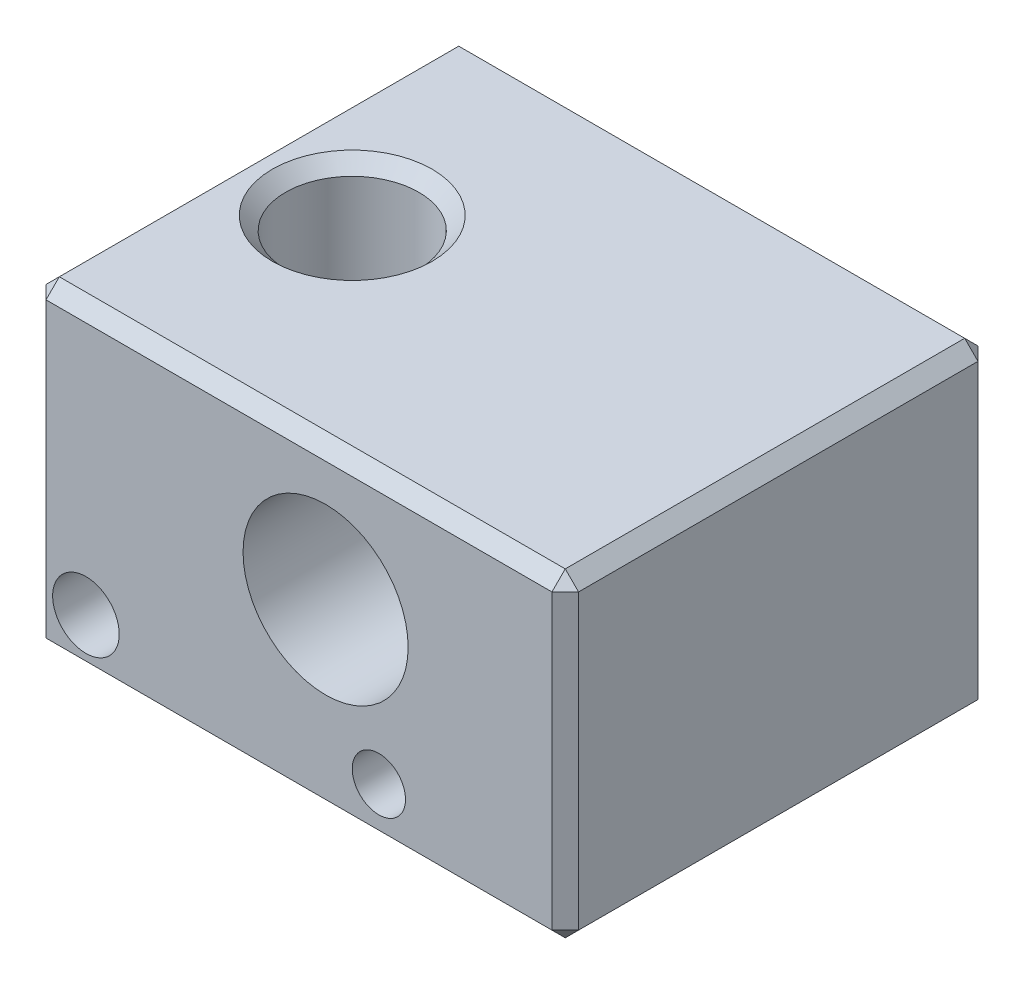
ISO-10303-21;
HEADER;
FILE_DESCRIPTION(('STEP AP214'),'2;1');
FILE_NAME('part.step','',(''),(''),'','','');
FILE_SCHEMA(('AUTOMOTIVE_DESIGN { 1 0 10303 214 1 1 1 1 }'));
ENDSEC;
DATA;
#1=APPLICATION_CONTEXT('core data for automotive mechanical design processes');
#2=APPLICATION_PROTOCOL_DEFINITION('international standard','automotive_design',2000,#1);
#3=PRODUCT_CONTEXT('',#1,'mechanical');
#4=PRODUCT('Part','Part','',(#3));
#5=PRODUCT_RELATED_PRODUCT_CATEGORY('part','',(#4));
#6=PRODUCT_DEFINITION_FORMATION('','',#4);
#7=PRODUCT_DEFINITION_CONTEXT('part definition',#1,'design');
#8=PRODUCT_DEFINITION('design','',#6,#7);
#9=PRODUCT_DEFINITION_SHAPE('','',#8);
#10=(LENGTH_UNIT() NAMED_UNIT(*) SI_UNIT(.MILLI.,.METRE.));
#11=(NAMED_UNIT(*) PLANE_ANGLE_UNIT() SI_UNIT($,.RADIAN.));
#12=(NAMED_UNIT(*) SI_UNIT($,.STERADIAN.) SOLID_ANGLE_UNIT());
#13=UNCERTAINTY_MEASURE_WITH_UNIT(LENGTH_MEASURE(1.E-05),#10,'distance_accuracy_value','');
#14=(GEOMETRIC_REPRESENTATION_CONTEXT(3) GLOBAL_UNCERTAINTY_ASSIGNED_CONTEXT((#13)) GLOBAL_UNIT_ASSIGNED_CONTEXT((#10,
#11,#12)) REPRESENTATION_CONTEXT('',''));
#15=CARTESIAN_POINT('',(0.,0.,0.));
#16=DIRECTION('',(0.,0.,1.));
#17=DIRECTION('',(1.,0.,0.));
#18=AXIS2_PLACEMENT_3D('',#15,#16,#17);
#19=CARTESIAN_POINT('',(-10.,12.,8.));
#20=DIRECTION('',(0.,0.,-1.));
#21=DIRECTION('',(-1.,0.,0.));
#22=AXIS2_PLACEMENT_3D('',#19,#20,#21);
#23=PLANE('',#22);
#24=DIRECTION('',(0.,-1.,0.));
#25=VECTOR('',#24,1.);
#26=CARTESIAN_POINT('',(-9.5,0.,8.));
#27=LINE('',#26,#25);
#28=CARTESIAN_POINT('',(-9.5,11.5,8.));
#29=VERTEX_POINT('',#28);
#30=CARTESIAN_POINT('',(-9.5,0.5,8.));
#31=VERTEX_POINT('',#30);
#32=EDGE_CURVE('E355',#29,#31,#27,.T.);
#33=ORIENTED_EDGE('',*,*,#32,.T.);
#34=DIRECTION('',(1.,0.,0.));
#35=VECTOR('',#34,1.);
#36=CARTESIAN_POINT('',(-10.,0.5,8.));
#37=LINE('',#36,#35);
#38=CARTESIAN_POINT('',(9.5,0.5,8.));
#39=VERTEX_POINT('',#38);
#40=EDGE_CURVE('E363',#31,#39,#37,.T.);
#41=ORIENTED_EDGE('',*,*,#40,.T.);
#42=DIRECTION('',(0.,1.,0.));
#43=VECTOR('',#42,1.);
#44=CARTESIAN_POINT('',(9.5,12.,8.));
#45=LINE('',#44,#43);
#46=CARTESIAN_POINT('',(9.5,11.5,8.));
#47=VERTEX_POINT('',#46);
#48=EDGE_CURVE('E345',#39,#47,#45,.T.);
#49=ORIENTED_EDGE('',*,*,#48,.T.);
#50=DIRECTION('',(-1.,0.,0.));
#51=VECTOR('',#50,1.);
#52=CARTESIAN_POINT('',(-10.,11.5,8.));
#53=LINE('',#52,#51);
#54=EDGE_CURVE('E351',#47,#29,#53,.T.);
#55=ORIENTED_EDGE('',*,*,#54,.T.);
#56=EDGE_LOOP('',(#33,#41,#49,#55));
#57=FACE_BOUND('',#56,.T.);
#58=CARTESIAN_POINT('',(-8.,2.,8.));
#59=DIRECTION('',(0.,0.,1.));
#60=DIRECTION('',(1.,0.,0.));
#61=AXIS2_PLACEMENT_3D('',#58,#59,#60);
#62=CIRCLE('',#61,1.25);
#63=CARTESIAN_POINT('',(-6.75,2.,8.));
#64=VERTEX_POINT('',#63);
#65=EDGE_CURVE('E222',#64,#64,#62,.T.);
#66=ORIENTED_EDGE('',*,*,#65,.F.);
#67=EDGE_LOOP('',(#66));
#68=FACE_BOUND('',#67,.T.);
#69=CARTESIAN_POINT('',(3.,2.,8.));
#70=DIRECTION('',(0.,0.,1.));
#71=DIRECTION('',(1.,0.,0.));
#72=AXIS2_PLACEMENT_3D('',#69,#70,#71);
#73=CIRCLE('',#72,1.);
#74=CARTESIAN_POINT('',(4.,2.,8.));
#75=VERTEX_POINT('',#74);
#76=EDGE_CURVE('E420',#75,#75,#73,.T.);
#77=ORIENTED_EDGE('',*,*,#76,.F.);
#78=EDGE_LOOP('',(#77));
#79=FACE_BOUND('',#78,.T.);
#80=CARTESIAN_POINT('',(0.999999999999996,7.,8.));
#81=DIRECTION('',(0.,0.,1.));
#82=DIRECTION('',(1.,0.,0.));
#83=AXIS2_PLACEMENT_3D('',#80,#81,#82);
#84=CIRCLE('',#83,3.1);
#85=CARTESIAN_POINT('',(4.1,7.,8.));
#86=VERTEX_POINT('',#85);
#87=EDGE_CURVE('E414',#86,#86,#84,.T.);
#88=ORIENTED_EDGE('',*,*,#87,.F.);
#89=EDGE_LOOP('',(#88));
#90=FACE_BOUND('',#89,.T.);
#91=ADVANCED_FACE('F33',(#57,#68,#79,#90),#23,.F.);
#92=CARTESIAN_POINT('',(10.,12.,8.));
#93=DIRECTION('',(-1.,0.,0.));
#94=DIRECTION('',(0.,0.,1.));
#95=AXIS2_PLACEMENT_3D('',#92,#93,#94);
#96=PLANE('',#95);
#97=DIRECTION('',(0.,0.,1.));
#98=VECTOR('',#97,1.);
#99=CARTESIAN_POINT('',(10.,11.5,8.));
#100=LINE('',#99,#98);
#101=CARTESIAN_POINT('',(10.,11.5,-7.5));
#102=VERTEX_POINT('',#101);
#103=CARTESIAN_POINT('',(10.,11.5,7.5));
#104=VERTEX_POINT('',#103);
#105=EDGE_CURVE('E365',#102,#104,#100,.T.);
#106=ORIENTED_EDGE('',*,*,#105,.T.);
#107=DIRECTION('',(0.,-1.,0.));
#108=VECTOR('',#107,1.);
#109=CARTESIAN_POINT('',(10.,12.,7.5));
#110=LINE('',#109,#108);
#111=CARTESIAN_POINT('',(10.,0.5,7.5));
#112=VERTEX_POINT('',#111);
#113=EDGE_CURVE('E347',#104,#112,#110,.T.);
#114=ORIENTED_EDGE('',*,*,#113,.T.);
#115=DIRECTION('',(0.,0.,-1.));
#116=VECTOR('',#115,1.);
#117=CARTESIAN_POINT('',(10.,0.5,8.));
#118=LINE('',#117,#116);
#119=CARTESIAN_POINT('',(10.,0.5,-7.5));
#120=VERTEX_POINT('',#119);
#121=EDGE_CURVE('E369',#112,#120,#118,.T.);
#122=ORIENTED_EDGE('',*,*,#121,.T.);
#123=DIRECTION('',(0.,1.,0.));
#124=VECTOR('',#123,1.);
#125=CARTESIAN_POINT('',(10.,12.,-7.5));
#126=LINE('',#125,#124);
#127=EDGE_CURVE('E367',#120,#102,#126,.T.);
#128=ORIENTED_EDGE('',*,*,#127,.T.);
#129=EDGE_LOOP('',(#106,#114,#122,#128));
#130=FACE_BOUND('',#129,.T.);
#131=ADVANCED_FACE('F255',(#130),#96,.F.);
#132=CARTESIAN_POINT('',(-10.,12.,-8.));
#133=DIRECTION('',(0.,0.,-1.));
#134=DIRECTION('',(-1.,0.,0.));
#135=AXIS2_PLACEMENT_3D('',#132,#133,#134);
#136=PLANE('',#135);
#137=DIRECTION('',(-1.,0.,0.));
#138=VECTOR('',#137,1.);
#139=CARTESIAN_POINT('',(-10.,0.5,-8.));
#140=LINE('',#139,#138);
#141=CARTESIAN_POINT('',(9.5,0.5,-8.));
#142=VERTEX_POINT('',#141);
#143=CARTESIAN_POINT('',(-9.5,0.5,-8.));
#144=VERTEX_POINT('',#143);
#145=EDGE_CURVE('E358',#142,#144,#140,.T.);
#146=ORIENTED_EDGE('',*,*,#145,.T.);
#147=DIRECTION('',(0.,1.,0.));
#148=VECTOR('',#147,1.);
#149=CARTESIAN_POINT('',(-9.5,12.,-8.));
#150=LINE('',#149,#148);
#151=CARTESIAN_POINT('',(-9.5,11.5,-8.));
#152=VERTEX_POINT('',#151);
#153=EDGE_CURVE('E353',#144,#152,#150,.T.);
#154=ORIENTED_EDGE('',*,*,#153,.T.);
#155=DIRECTION('',(1.,0.,0.));
#156=VECTOR('',#155,1.);
#157=CARTESIAN_POINT('',(-10.,11.5,-8.));
#158=LINE('',#157,#156);
#159=CARTESIAN_POINT('',(9.5,11.5,-8.));
#160=VERTEX_POINT('',#159);
#161=EDGE_CURVE('E384',#152,#160,#158,.T.);
#162=ORIENTED_EDGE('',*,*,#161,.T.);
#163=DIRECTION('',(0.,-1.,0.));
#164=VECTOR('',#163,1.);
#165=CARTESIAN_POINT('',(9.5,0.,-8.));
#166=LINE('',#165,#164);
#167=EDGE_CURVE('E386',#160,#142,#166,.T.);
#168=ORIENTED_EDGE('',*,*,#167,.T.);
#169=EDGE_LOOP('',(#146,#154,#162,#168));
#170=FACE_BOUND('',#169,.T.);
#171=CARTESIAN_POINT('',(3.,2.,-8.));
#172=DIRECTION('',(0.,0.,1.));
#173=DIRECTION('',(1.,0.,0.));
#174=AXIS2_PLACEMENT_3D('',#171,#172,#173);
#175=CIRCLE('',#174,1.);
#176=CARTESIAN_POINT('',(4.,2.,-8.));
#177=VERTEX_POINT('',#176);
#178=EDGE_CURVE('E417',#177,#177,#175,.T.);
#179=ORIENTED_EDGE('',*,*,#178,.T.);
#180=EDGE_LOOP('',(#179));
#181=FACE_BOUND('',#180,.T.);
#182=CARTESIAN_POINT('',(0.999999999999996,7.,-8.));
#183=DIRECTION('',(0.,0.,1.));
#184=DIRECTION('',(1.,0.,0.));
#185=AXIS2_PLACEMENT_3D('',#182,#183,#184);
#186=CIRCLE('',#185,3.1);
#187=CARTESIAN_POINT('',(4.1,7.,-8.));
#188=VERTEX_POINT('',#187);
#189=EDGE_CURVE('E143',#188,#188,#186,.T.);
#190=ORIENTED_EDGE('',*,*,#189,.T.);
#191=EDGE_LOOP('',(#190));
#192=FACE_BOUND('',#191,.T.);
#193=ADVANCED_FACE('F261',(#170,#181,#192),#136,.T.);
#194=CARTESIAN_POINT('',(-10.,12.,8.));
#195=DIRECTION('',(-1.,0.,0.));
#196=DIRECTION('',(0.,0.,1.));
#197=AXIS2_PLACEMENT_3D('',#194,#195,#196);
#198=PLANE('',#197);
#199=DIRECTION('',(0.,-1.,0.));
#200=VECTOR('',#199,1.);
#201=CARTESIAN_POINT('',(-10.,12.,-7.5));
#202=LINE('',#201,#200);
#203=CARTESIAN_POINT('',(-10.,11.5,-7.5));
#204=VERTEX_POINT('',#203);
#205=CARTESIAN_POINT('',(-10.,0.5,-7.5));
#206=VERTEX_POINT('',#205);
#207=EDGE_CURVE('E379',#204,#206,#202,.T.);
#208=ORIENTED_EDGE('',*,*,#207,.T.);
#209=DIRECTION('',(0.,0.,1.));
#210=VECTOR('',#209,1.);
#211=CARTESIAN_POINT('',(-10.,0.5,8.));
#212=LINE('',#211,#210);
#213=CARTESIAN_POINT('',(-10.,0.5,7.5));
#214=VERTEX_POINT('',#213);
#215=EDGE_CURVE('E149',#206,#214,#212,.T.);
#216=ORIENTED_EDGE('',*,*,#215,.T.);
#217=DIRECTION('',(0.,1.,0.));
#218=VECTOR('',#217,1.);
#219=CARTESIAN_POINT('',(-10.,12.,7.5));
#220=LINE('',#219,#218);
#221=CARTESIAN_POINT('',(-10.,11.5,7.5));
#222=VERTEX_POINT('',#221);
#223=EDGE_CURVE('E393',#214,#222,#220,.T.);
#224=ORIENTED_EDGE('',*,*,#223,.T.);
#225=DIRECTION('',(0.,0.,-1.));
#226=VECTOR('',#225,1.);
#227=CARTESIAN_POINT('',(-10.,11.5,8.));
#228=LINE('',#227,#226);
#229=EDGE_CURVE('E395',#222,#204,#228,.T.);
#230=ORIENTED_EDGE('',*,*,#229,.T.);
#231=EDGE_LOOP('',(#208,#216,#224,#230));
#232=FACE_BOUND('',#231,.T.);
#233=ADVANCED_FACE('F455',(#232),#198,.T.);
#234=CARTESIAN_POINT('',(0.,12.,0.));
#235=DIRECTION('',(0.,1.,0.));
#236=DIRECTION('',(0.,0.,1.));
#237=AXIS2_PLACEMENT_3D('',#234,#235,#236);
#238=PLANE('',#237);
#239=DIRECTION('',(-1.,0.,0.));
#240=VECTOR('',#239,1.);
#241=CARTESIAN_POINT('',(0.,12.,-7.5));
#242=LINE('',#241,#240);
#243=CARTESIAN_POINT('',(9.5,12.,-7.5));
#244=VERTEX_POINT('',#243);
#245=CARTESIAN_POINT('',(-9.5,12.,-7.5));
#246=VERTEX_POINT('',#245);
#247=EDGE_CURVE('E42',#244,#246,#242,.T.);
#248=ORIENTED_EDGE('',*,*,#247,.T.);
#249=DIRECTION('',(0.,0.,1.));
#250=VECTOR('',#249,1.);
#251=CARTESIAN_POINT('',(-9.5,12.,0.));
#252=LINE('',#251,#250);
#253=CARTESIAN_POINT('',(-9.5,12.,7.5));
#254=VERTEX_POINT('',#253);
#255=EDGE_CURVE('E11',#246,#254,#252,.T.);
#256=ORIENTED_EDGE('',*,*,#255,.T.);
#257=DIRECTION('',(1.,0.,0.));
#258=VECTOR('',#257,1.);
#259=CARTESIAN_POINT('',(10.,12.,7.5));
#260=LINE('',#259,#258);
#261=CARTESIAN_POINT('',(9.5,12.,7.5));
#262=VERTEX_POINT('',#261);
#263=EDGE_CURVE('E375',#254,#262,#260,.T.);
#264=ORIENTED_EDGE('',*,*,#263,.T.);
#265=DIRECTION('',(0.,0.,-1.));
#266=VECTOR('',#265,1.);
#267=CARTESIAN_POINT('',(9.5,12.,-8.));
#268=LINE('',#267,#266);
#269=EDGE_CURVE('E53',#262,#244,#268,.T.);
#270=ORIENTED_EDGE('',*,*,#269,.T.);
#271=EDGE_LOOP('',(#248,#256,#264,#270));
#272=FACE_BOUND('',#271,.T.);
#273=CARTESIAN_POINT('',(-6.,12.,0.));
#274=DIRECTION('',(0.,1.,0.));
#275=DIRECTION('',(0.,0.,1.));
#276=AXIS2_PLACEMENT_3D('',#273,#274,#275);
#277=CIRCLE('',#276,2.99999999999999);
#278=CARTESIAN_POINT('',(-6.,12.,2.99999999999999));
#279=VERTEX_POINT('',#278);
#280=EDGE_CURVE('E372',#279,#279,#277,.F.);
#281=ORIENTED_EDGE('',*,*,#280,.T.);
#282=EDGE_LOOP('',(#281));
#283=FACE_BOUND('',#282,.T.);
#284=ADVANCED_FACE('F448',(#272,#283),#238,.T.);
#285=CARTESIAN_POINT('',(0.,0.,0.));
#286=DIRECTION('',(0.,1.,0.));
#287=DIRECTION('',(0.,0.,1.));
#288=AXIS2_PLACEMENT_3D('',#285,#286,#287);
#289=PLANE('',#288);
#290=CARTESIAN_POINT('',(-6.,0.,0.));
#291=DIRECTION('',(0.,1.,0.));
#292=DIRECTION('',(0.,0.,1.));
#293=AXIS2_PLACEMENT_3D('',#290,#291,#292);
#294=CIRCLE('',#293,3.);
#295=CARTESIAN_POINT('',(-6.,0.,3.));
#296=VERTEX_POINT('',#295);
#297=EDGE_CURVE('E405',#296,#296,#294,.T.);
#298=ORIENTED_EDGE('',*,*,#297,.T.);
#299=EDGE_LOOP('',(#298));
#300=FACE_BOUND('',#299,.T.);
#301=CARTESIAN_POINT('',(0.,0.,0.));
#302=DIRECTION('',(0.,1.,0.));
#303=DIRECTION('',(0.,0.,1.));
#304=AXIS2_PLACEMENT_3D('',#301,#302,#303);
#305=CIRCLE('',#304,1.75000000000001);
#306=CARTESIAN_POINT('',(0.,0.,1.75000000000001));
#307=VERTEX_POINT('',#306);
#308=EDGE_CURVE('E408',#307,#307,#305,.T.);
#309=ORIENTED_EDGE('',*,*,#308,.T.);
#310=EDGE_LOOP('',(#309));
#311=FACE_BOUND('',#310,.T.);
#312=DIRECTION('',(1.,0.,0.));
#313=VECTOR('',#312,1.);
#314=CARTESIAN_POINT('',(10.,0.,-7.5));
#315=LINE('',#314,#313);
#316=CARTESIAN_POINT('',(-9.5,0.,-7.5));
#317=VERTEX_POINT('',#316);
#318=CARTESIAN_POINT('',(9.5,0.,-7.5));
#319=VERTEX_POINT('',#318);
#320=EDGE_CURVE('E125',#317,#319,#315,.T.);
#321=ORIENTED_EDGE('',*,*,#320,.T.);
#322=DIRECTION('',(0.,0.,1.));
#323=VECTOR('',#322,1.);
#324=CARTESIAN_POINT('',(9.5,0.,0.));
#325=LINE('',#324,#323);
#326=CARTESIAN_POINT('',(9.5,0.,7.5));
#327=VERTEX_POINT('',#326);
#328=EDGE_CURVE('E411',#319,#327,#325,.T.);
#329=ORIENTED_EDGE('',*,*,#328,.T.);
#330=DIRECTION('',(-1.,0.,0.));
#331=VECTOR('',#330,1.);
#332=CARTESIAN_POINT('',(0.,0.,7.5));
#333=LINE('',#332,#331);
#334=CARTESIAN_POINT('',(-9.5,0.,7.5));
#335=VERTEX_POINT('',#334);
#336=EDGE_CURVE('E127',#327,#335,#333,.T.);
#337=ORIENTED_EDGE('',*,*,#336,.T.);
#338=DIRECTION('',(0.,0.,-1.));
#339=VECTOR('',#338,1.);
#340=CARTESIAN_POINT('',(-9.5,0.,-8.));
#341=LINE('',#340,#339);
#342=EDGE_CURVE('E121',#335,#317,#341,.T.);
#343=ORIENTED_EDGE('',*,*,#342,.T.);
#344=EDGE_LOOP('',(#321,#329,#337,#343));
#345=FACE_BOUND('',#344,.T.);
#346=ADVANCED_FACE('F123',(#300,#311,#345),#289,.F.);
#347=CARTESIAN_POINT('',(0.999999999999996,7.,-8.));
#348=DIRECTION('',(0.,0.,1.));
#349=DIRECTION('',(1.,0.,0.));
#350=AXIS2_PLACEMENT_3D('',#347,#348,#349);
#351=CYLINDRICAL_SURFACE('',#350,3.1);
#352=CARTESIAN_POINT('',(0.,4.06571984977576,-1.25));
#353=CARTESIAN_POINT('',(0.064124071027608,4.04386931657047,-1.24999682356544));
#354=CARTESIAN_POINT('',(0.129032360554399,4.02411324985325,-1.24504633684303));
#355=CARTESIAN_POINT('',(0.258525144505243,3.98923249124023,-1.2247308171228));
#356=CARTESIAN_POINT('',(0.32310928391037,3.97411209996811,-1.20935615557821));
#357=CARTESIAN_POINT('',(0.449899512406872,3.94851243111399,-1.16813357100094));
#358=CARTESIAN_POINT('',(0.512103122486296,3.93803787752112,-1.14227503862974));
#359=CARTESIAN_POINT('',(0.631955712754432,3.92132984840443,-1.08059009030169));
#360=CARTESIAN_POINT('',(0.689605229796952,3.9150958723238,-1.04476485151625));
#361=CARTESIAN_POINT('',(0.797496465489572,3.9061553785297,-0.964844569883467));
#362=CARTESIAN_POINT('',(0.847854687064661,3.90338624247298,-0.920913307988029));
#363=CARTESIAN_POINT('',(0.940965154049164,3.9002113379841,-0.82554699120182));
#364=CARTESIAN_POINT('',(0.983716117904884,3.89980596739803,-0.774110674626252));
#365=CARTESIAN_POINT('',(1.06159260293196,3.90035946609992,-0.663497060760646));
#366=CARTESIAN_POINT('',(1.09645925371717,3.90135848340574,-0.604137697597039));
#367=CARTESIAN_POINT('',(1.15599100394901,3.90378325578923,-0.480513323236181));
#368=CARTESIAN_POINT('',(1.18065507855612,3.90520905371185,-0.416247819989271));
#369=CARTESIAN_POINT('',(1.21956346048699,3.90772172802315,-0.283004227305717));
#370=CARTESIAN_POINT('',(1.23355335949015,3.90879999521813,-0.213951486933704));
#371=CARTESIAN_POINT('',(1.24975342466547,3.91006624436077,-0.0744708002820155));
#372=CARTESIAN_POINT('',(1.25196372633312,3.91025423654886,-0.00404286982989407));
#373=CARTESIAN_POINT('',(1.24454584579713,3.90965852729883,0.13610331981758));
#374=CARTESIAN_POINT('',(1.23493084752302,3.90887590797932,0.205822282120605));
#375=CARTESIAN_POINT('',(1.20416096316388,3.90669215451381,0.342658473349359));
#376=CARTESIAN_POINT('',(1.18300525336871,3.90529097621996,0.40977551619864));
#377=CARTESIAN_POINT('',(1.12971705925274,3.90260076032698,0.539600864597367));
#378=CARTESIAN_POINT('',(1.09757104261828,3.90131186344619,0.60230361952702));
#379=CARTESIAN_POINT('',(1.02320544748314,3.89986461575388,0.721443742705736));
#380=CARTESIAN_POINT('',(0.980985762749071,3.89970627686539,0.777881044872325));
#381=CARTESIAN_POINT('',(0.887833426064141,3.90168164861602,0.882695629692791));
#382=CARTESIAN_POINT('',(0.836927894708408,3.90380833082803,0.93109710222515));
#383=CARTESIAN_POINT('',(0.727899032748647,3.91148275042813,1.01859946114047));
#384=CARTESIAN_POINT('',(0.669777942738395,3.91702942794207,1.0577032237314));
#385=CARTESIAN_POINT('',(0.550126448606881,3.93224260272356,1.12446031488305));
#386=CARTESIAN_POINT('',(0.488753555935226,3.94177863189459,1.15242580114433));
#387=CARTESIAN_POINT('',(0.363121256671629,3.96545446304068,1.19795912574914));
#388=CARTESIAN_POINT('',(0.298862321907114,3.97959351483077,1.21552865707629));
#389=CARTESIAN_POINT('',(0.17069358533456,4.01226682493206,1.23997912488615));
#390=CARTESIAN_POINT('',(0.10679724119452,4.03072012533362,1.24704113706528));
#391=CARTESIAN_POINT('',(-0.0199540287237388,4.07183711455998,1.25145005951005));
#392=CARTESIAN_POINT('',(-0.0828086645287694,4.09450195497261,1.24879430886528));
#393=CARTESIAN_POINT('',(-0.209600036473879,4.14486637335437,1.23404889696497));
#394=CARTESIAN_POINT('',(-0.273386599842198,4.17278229677925,1.22141881599695));
#395=CARTESIAN_POINT('',(-0.396905372100119,4.23172480365729,1.18704722608765));
#396=CARTESIAN_POINT('',(-0.456636559363055,4.26275216610093,1.16530343105147));
#397=CARTESIAN_POINT('',(-0.5788293663895,4.33113821293562,1.11019217671031));
#398=CARTESIAN_POINT('',(-0.640603217679626,4.36879094402457,1.07566592104613));
#399=CARTESIAN_POINT('',(-0.757171003064263,4.4451575339971,0.997068324896725));
#400=CARTESIAN_POINT('',(-0.811952114968924,4.48387318839118,0.952979839015349));
#401=CARTESIAN_POINT('',(-0.920188682014274,4.5652493581044,0.849732089139413));
#402=CARTESIAN_POINT('',(-0.972597371124593,4.60778841664885,0.789371256481532));
#403=CARTESIAN_POINT('',(-1.06605948810039,4.68803781259185,0.657652699139254));
#404=CARTESIAN_POINT('',(-1.10714159613293,4.72576021366949,0.586323475339552));
#405=CARTESIAN_POINT('',(-1.16241507543724,4.77855333774515,0.462557639917997));
#406=CARTESIAN_POINT('',(-1.18087686645187,4.79676287087564,0.413367344271983));
#407=CARTESIAN_POINT('',(-1.21173019471206,4.82773679133903,0.311499179493664));
#408=CARTESIAN_POINT('',(-1.22413145575759,4.84050989685295,0.258827051979022));
#409=CARTESIAN_POINT('',(-1.24211845369059,4.85918640303963,0.15057680708634));
#410=CARTESIAN_POINT('',(-1.24764053834643,4.86502562241385,0.0949764403431565));
#411=CARTESIAN_POINT('',(-1.25113452717186,4.86870869109976,-0.0167257193774429));
#412=CARTESIAN_POINT('',(-1.24910930600025,4.86655558457314,-0.0728273133239355));
#413=CARTESIAN_POINT('',(-1.23842148340766,4.85535245667868,-0.176640207564638));
#414=CARTESIAN_POINT('',(-1.23059804896538,4.84717513891782,-0.224540654398174));
#415=CARTESIAN_POINT('',(-1.20981016959182,4.82584267352126,-0.318052868932751));
#416=CARTESIAN_POINT('',(-1.1968419838475,4.81268390412906,-0.363662944029742));
#417=CARTESIAN_POINT('',(-1.15983735075625,4.77603236941032,-0.470880626168048));
#418=CARTESIAN_POINT('',(-1.13343924980129,4.75052707780666,-0.530981431141113));
#419=CARTESIAN_POINT('',(-1.07288790319374,4.69460608468316,-0.644654810619276));
#420=CARTESIAN_POINT('',(-1.03871641183915,4.66417887978582,-0.69821156288247));
#421=CARTESIAN_POINT('',(-0.953367317289482,4.59204167799534,-0.812383187083015));
#422=CARTESIAN_POINT('',(-0.900094644354952,4.54952185264108,-0.870922323350584));
#423=CARTESIAN_POINT('',(-0.783905217285025,4.46368107503741,-0.976818044097295));
#424=CARTESIAN_POINT('',(-0.720980083661197,4.42035945574847,-1.02416482064182));
#425=CARTESIAN_POINT('',(-0.586072233846567,4.33527163579194,-1.10694157287936));
#426=CARTESIAN_POINT('',(-0.514037174431014,4.29351639302137,-1.14229794759976));
#427=CARTESIAN_POINT('',(-0.362656537884229,4.21424966883542,-1.19894283194075));
#428=CARTESIAN_POINT('',(-0.283337384865589,4.17672386857872,-1.22028006615794));
#429=CARTESIAN_POINT('',(-0.168632060693813,4.12848715119251,-1.23902278442863));
#430=CARTESIAN_POINT('',(-0.135339992437537,4.11516072866024,-1.2431091379948));
#431=CARTESIAN_POINT('',(-0.0681062925718616,4.08959773467645,-1.24859903306798));
#432=CARTESIAN_POINT('',(-0.0341644510640823,4.07736152287063,-1.25000169236203));
#433=CARTESIAN_POINT('',(0.,4.06571984977576,-1.25));
#434=B_SPLINE_CURVE_WITH_KNOTS('',3,(#352,#353,#354,#355,#356,#357,#358,#359,#360,#361,#362,
#363,#364,#365,#366,#367,#368,#369,#370,#371,#372,#373,#374,#375,#376,#377,#378,#379,#380,#381,
#382,#383,#384,#385,#386,#387,#388,#389,#390,#391,#392,#393,#394,#395,#396,#397,#398,#399,#400,
#401,#402,#403,#404,#405,#406,#407,#408,#409,#410,#411,#412,#413,#414,#415,#416,#417,#418,#419,
#420,#421,#422,#423,#424,#425,#426,#427,#428,#429,#430,#431,#432,#433),.UNSPECIFIED.,.T.,.F.,(4,
2,2,2,2,2,2,2,2,2,2,2,2,2,2,2,2,2,2,2,2,2,2,2,2,2,2,2,2,2,2,2,2,2,2,2,2,2,2,2,4),(0.,
0.203106901637014,0.406401664025733,0.609902669700281,0.813379649991947,1.01312353075626,
1.2129010295035,1.41850722043965,1.62413405931889,1.8345206735449,2.04490486778158,
2.25505471888996,2.46521957125866,2.67564413620872,2.88607092032087,3.09585230705912,
3.30556871411917,3.50890505804193,3.71220827947523,3.91196568210336,4.11177778624365,
4.32322687709548,4.53472903986193,4.77426968848166,5.01424344552384,5.2846125683601,
5.5542906639938,5.72053905381197,5.88651982393156,6.0540252551378,6.22146689248856,
6.36849795003852,6.5156361122296,6.72574116876293,6.93634456763191,7.20454767246494,
7.47298494124714,7.74304134015155,8.01215410127128,8.12033119852702,8.22854385082052),.UNSPECIFIED.);
#435=CARTESIAN_POINT('',(0.,4.06571984977576,-1.25));
#436=VERTEX_POINT('',#435);
#437=EDGE_CURVE('E216',#436,#436,#434,.T.);
#438=ORIENTED_EDGE('',*,*,#437,.T.);
#439=EDGE_LOOP('',(#438));
#440=FACE_BOUND('',#439,.T.);
#441=ORIENTED_EDGE('',*,*,#189,.F.);
#442=EDGE_LOOP('',(#441));
#443=FACE_BOUND('',#442,.T.);
#444=ORIENTED_EDGE('',*,*,#87,.T.);
#445=EDGE_LOOP('',(#444));
#446=FACE_BOUND('',#445,.T.);
#447=ADVANCED_FACE('F438',(#440,#443,#446),#351,.F.);
#448=CARTESIAN_POINT('',(3.,2.,-8.));
#449=DIRECTION('',(0.,0.,1.));
#450=DIRECTION('',(1.,0.,0.));
#451=AXIS2_PLACEMENT_3D('',#448,#449,#450);
#452=CYLINDRICAL_SURFACE('',#451,1.);
#453=ORIENTED_EDGE('',*,*,#178,.F.);
#454=EDGE_LOOP('',(#453));
#455=FACE_BOUND('',#454,.T.);
#456=ORIENTED_EDGE('',*,*,#76,.T.);
#457=EDGE_LOOP('',(#456));
#458=FACE_BOUND('',#457,.T.);
#459=ADVANCED_FACE('F440',(#455,#458),#452,.F.);
#460=CARTESIAN_POINT('',(-8.00000000000001,2.,3.5));
#461=DIRECTION('',(0.,0.,-1.));
#462=DIRECTION('',(-1.,0.,0.));
#463=AXIS2_PLACEMENT_3D('',#460,#461,#462);
#464=PLANE('',#463);
#465=CARTESIAN_POINT('',(-8.,2.,3.5));
#466=DIRECTION('',(0.,0.,1.));
#467=DIRECTION('',(1.,0.,0.));
#468=AXIS2_PLACEMENT_3D('',#465,#466,#467);
#469=CIRCLE('',#468,1.25);
#470=CARTESIAN_POINT('',(-6.75,2.,3.5));
#471=VERTEX_POINT('',#470);
#472=EDGE_CURVE('E227',#471,#471,#469,.T.);
#473=ORIENTED_EDGE('',*,*,#472,.T.);
#474=EDGE_LOOP('',(#473));
#475=FACE_BOUND('',#474,.T.);
#476=ADVANCED_FACE('F427',(#475),#464,.F.);
#477=CARTESIAN_POINT('',(-8.,2.,8.));
#478=DIRECTION('',(0.,0.,1.));
#479=DIRECTION('',(1.,0.,0.));
#480=AXIS2_PLACEMENT_3D('',#477,#478,#479);
#481=CYLINDRICAL_SURFACE('',#480,1.25);
#482=ORIENTED_EDGE('',*,*,#472,.F.);
#483=EDGE_LOOP('',(#482));
#484=FACE_BOUND('',#483,.T.);
#485=ORIENTED_EDGE('',*,*,#65,.T.);
#486=EDGE_LOOP('',(#485));
#487=FACE_BOUND('',#486,.T.);
#488=ADVANCED_FACE('F250',(#484,#487),#481,.F.);
#489=CARTESIAN_POINT('',(-6.,12.,0.));
#490=DIRECTION('',(0.,1.,0.));
#491=DIRECTION('',(0.,0.,1.));
#492=AXIS2_PLACEMENT_3D('',#489,#490,#491);
#493=CYLINDRICAL_SURFACE('',#492,2.49999999999999);
#494=CARTESIAN_POINT('',(-6.,0.500000000000004,0.));
#495=DIRECTION('',(0.,1.,0.));
#496=DIRECTION('',(0.,0.,1.));
#497=AXIS2_PLACEMENT_3D('',#494,#495,#496);
#498=CIRCLE('',#497,2.49999999999999);
#499=CARTESIAN_POINT('',(-6.,0.500000000000004,2.49999999999999));
#500=VERTEX_POINT('',#499);
#501=EDGE_CURVE('E399',#500,#500,#498,.F.);
#502=ORIENTED_EDGE('',*,*,#501,.T.);
#503=EDGE_LOOP('',(#502));
#504=FACE_BOUND('',#503,.T.);
#505=CARTESIAN_POINT('',(-6.,11.5,0.));
#506=DIRECTION('',(0.,1.,0.));
#507=DIRECTION('',(0.,0.,1.));
#508=AXIS2_PLACEMENT_3D('',#505,#506,#507);
#509=CIRCLE('',#508,2.49999999999999);
#510=CARTESIAN_POINT('',(-6.,11.5,2.49999999999999));
#511=VERTEX_POINT('',#510);
#512=EDGE_CURVE('E402',#511,#511,#509,.T.);
#513=ORIENTED_EDGE('',*,*,#512,.T.);
#514=EDGE_LOOP('',(#513));
#515=FACE_BOUND('',#514,.T.);
#516=ADVANCED_FACE('F241',(#504,#515),#493,.F.);
#517=CARTESIAN_POINT('',(0.,0.,0.));
#518=DIRECTION('',(0.,-1.,0.));
#519=DIRECTION('',(0.,0.,-1.));
#520=AXIS2_PLACEMENT_3D('',#517,#518,#519);
#521=CYLINDRICAL_SURFACE('',#520,1.25);
#522=CARTESIAN_POINT('',(0.,0.500000000000003,0.));
#523=DIRECTION('',(0.,1.,0.));
#524=DIRECTION('',(0.,0.,1.));
#525=AXIS2_PLACEMENT_3D('',#522,#523,#524);
#526=CIRCLE('',#525,1.25);
#527=CARTESIAN_POINT('',(0.,0.500000000000003,1.25));
#528=VERTEX_POINT('',#527);
#529=EDGE_CURVE('E397',#528,#528,#526,.F.);
#530=ORIENTED_EDGE('',*,*,#529,.T.);
#531=EDGE_LOOP('',(#530));
#532=FACE_BOUND('',#531,.T.);
#533=ORIENTED_EDGE('',*,*,#437,.F.);
#534=EDGE_LOOP('',(#533));
#535=FACE_BOUND('',#534,.T.);
#536=ADVANCED_FACE('F237',(#532,#535),#521,.F.);
#537=CARTESIAN_POINT('',(-6.,0.,0.));
#538=DIRECTION('',(0.,-1.,0.));
#539=DIRECTION('',(0.,0.,-1.));
#540=AXIS2_PLACEMENT_3D('',#537,#538,#539);
#541=CONICAL_SURFACE('',#540,3.,0.785398163397447);
#542=ORIENTED_EDGE('',*,*,#501,.F.);
#543=EDGE_LOOP('',(#542));
#544=FACE_BOUND('',#543,.T.);
#545=ORIENTED_EDGE('',*,*,#297,.F.);
#546=EDGE_LOOP('',(#545));
#547=FACE_BOUND('',#546,.T.);
#548=ADVANCED_FACE('F240',(#544,#547),#541,.F.);
#549=CARTESIAN_POINT('',(0.,0.500000000000003,0.));
#550=DIRECTION('',(0.,-1.,0.));
#551=DIRECTION('',(0.,0.,-1.));
#552=AXIS2_PLACEMENT_3D('',#549,#550,#551);
#553=CONICAL_SURFACE('',#552,1.25,0.785398163397451);
#554=ORIENTED_EDGE('',*,*,#308,.F.);
#555=EDGE_LOOP('',(#554));
#556=FACE_BOUND('',#555,.T.);
#557=ORIENTED_EDGE('',*,*,#529,.F.);
#558=EDGE_LOOP('',(#557));
#559=FACE_BOUND('',#558,.T.);
#560=ADVANCED_FACE('F247',(#556,#559),#553,.F.);
#561=CARTESIAN_POINT('',(10.,12.,7.5));
#562=DIRECTION('',(-0.707106781186547,0.,-0.707106781186547));
#563=DIRECTION('',(0.,-1.,0.));
#564=AXIS2_PLACEMENT_3D('',#561,#562,#563);
#565=PLANE('',#564);
#566=DIRECTION('',(-0.707106781186547,0.,0.707106781186547));
#567=VECTOR('',#566,1.);
#568=CARTESIAN_POINT('',(9.5,11.5,8.));
#569=LINE('',#568,#567);
#570=EDGE_CURVE('E37',#47,#104,#569,.F.);
#571=ORIENTED_EDGE('',*,*,#570,.F.);
#572=ORIENTED_EDGE('',*,*,#48,.F.);
#573=DIRECTION('',(0.707106781186547,0.,-0.707106781186547));
#574=VECTOR('',#573,1.);
#575=CARTESIAN_POINT('',(10.,0.5,7.5));
#576=LINE('',#575,#574);
#577=EDGE_CURVE('E209',#112,#39,#576,.F.);
#578=ORIENTED_EDGE('',*,*,#577,.F.);
#579=ORIENTED_EDGE('',*,*,#113,.F.);
#580=EDGE_LOOP('',(#571,#572,#578,#579));
#581=FACE_BOUND('',#580,.T.);
#582=ADVANCED_FACE('F270',(#581),#565,.F.);
#583=CARTESIAN_POINT('',(9.5,11.5,8.));
#584=DIRECTION('',(0.577350269189626,0.577350269189626,0.577350269189626));
#585=DIRECTION('',(0.707106781186547,0.,-0.707106781186547));
#586=AXIS2_PLACEMENT_3D('',#583,#584,#585);
#587=PLANE('',#586);
#588=DIRECTION('',(0.,-0.707106781186547,0.707106781186547));
#589=VECTOR('',#588,1.);
#590=CARTESIAN_POINT('',(9.5,11.5,8.));
#591=LINE('',#590,#589);
#592=EDGE_CURVE('E204',#47,#262,#591,.F.);
#593=ORIENTED_EDGE('',*,*,#592,.F.);
#594=ORIENTED_EDGE('',*,*,#570,.T.);
#595=DIRECTION('',(-0.707106781186547,0.707106781186547,0.));
#596=VECTOR('',#595,1.);
#597=CARTESIAN_POINT('',(9.75,11.75,7.5));
#598=LINE('',#597,#596);
#599=EDGE_CURVE('E207',#262,#104,#598,.F.);
#600=ORIENTED_EDGE('',*,*,#599,.F.);
#601=EDGE_LOOP('',(#593,#594,#600));
#602=FACE_BOUND('',#601,.T.);
#603=ADVANCED_FACE('F337',(#602),#587,.T.);
#604=CARTESIAN_POINT('',(10.,0.5,7.5));
#605=DIRECTION('',(0.577350269189626,-0.577350269189626,0.577350269189626));
#606=DIRECTION('',(0.707106781186547,0.,-0.707106781186547));
#607=AXIS2_PLACEMENT_3D('',#604,#605,#606);
#608=PLANE('',#607);
#609=DIRECTION('',(-0.707106781186547,-0.707106781186547,0.));
#610=VECTOR('',#609,1.);
#611=CARTESIAN_POINT('',(10.,0.5,7.5));
#612=LINE('',#611,#610);
#613=EDGE_CURVE('E198',#112,#327,#612,.T.);
#614=ORIENTED_EDGE('',*,*,#613,.F.);
#615=ORIENTED_EDGE('',*,*,#577,.T.);
#616=DIRECTION('',(0.,0.707106781186547,0.707106781186547));
#617=VECTOR('',#616,1.);
#618=CARTESIAN_POINT('',(9.5,0.25,7.75));
#619=LINE('',#618,#617);
#620=EDGE_CURVE('E201',#327,#39,#619,.T.);
#621=ORIENTED_EDGE('',*,*,#620,.F.);
#622=EDGE_LOOP('',(#614,#615,#621));
#623=FACE_BOUND('',#622,.T.);
#624=ADVANCED_FACE('F333',(#623),#608,.T.);
#625=CARTESIAN_POINT('',(9.5,12.,0.));
#626=DIRECTION('',(0.707106781186547,0.707106781186547,0.));
#627=DIRECTION('',(0.,0.,1.));
#628=AXIS2_PLACEMENT_3D('',#625,#626,#627);
#629=PLANE('',#628);
#630=ORIENTED_EDGE('',*,*,#599,.T.);
#631=ORIENTED_EDGE('',*,*,#105,.F.);
#632=DIRECTION('',(0.707106781186547,-0.707106781186547,0.));
#633=VECTOR('',#632,1.);
#634=CARTESIAN_POINT('',(10.,11.5,-7.5));
#635=LINE('',#634,#633);
#636=EDGE_CURVE('E192',#244,#102,#635,.T.);
#637=ORIENTED_EDGE('',*,*,#636,.F.);
#638=ORIENTED_EDGE('',*,*,#269,.F.);
#639=EDGE_LOOP('',(#630,#631,#637,#638));
#640=FACE_BOUND('',#639,.T.);
#641=ADVANCED_FACE('F329',(#640),#629,.T.);
#642=CARTESIAN_POINT('',(0.,12.,7.5));
#643=DIRECTION('',(0.,0.707106781186547,0.707106781186547));
#644=DIRECTION('',(-1.,0.,0.));
#645=AXIS2_PLACEMENT_3D('',#642,#643,#644);
#646=PLANE('',#645);
#647=ORIENTED_EDGE('',*,*,#592,.T.);
#648=ORIENTED_EDGE('',*,*,#263,.F.);
#649=DIRECTION('',(0.,0.707106781186547,-0.707106781186547));
#650=VECTOR('',#649,1.);
#651=CARTESIAN_POINT('',(-9.5,11.75,7.75));
#652=LINE('',#651,#650);
#653=EDGE_CURVE('E189',#29,#254,#652,.T.);
#654=ORIENTED_EDGE('',*,*,#653,.F.);
#655=ORIENTED_EDGE('',*,*,#54,.F.);
#656=EDGE_LOOP('',(#647,#648,#654,#655));
#657=FACE_BOUND('',#656,.T.);
#658=ADVANCED_FACE('F325',(#657),#646,.T.);
#659=CARTESIAN_POINT('',(-9.5,12.,8.));
#660=DIRECTION('',(-0.707106781186547,0.,0.707106781186547));
#661=DIRECTION('',(0.,1.,0.));
#662=AXIS2_PLACEMENT_3D('',#659,#660,#661);
#663=PLANE('',#662);
#664=DIRECTION('',(-0.707106781186547,0.,-0.707106781186547));
#665=VECTOR('',#664,1.);
#666=CARTESIAN_POINT('',(-9.5,0.5,8.));
#667=LINE('',#666,#665);
#668=EDGE_CURVE('E183',#31,#214,#667,.T.);
#669=ORIENTED_EDGE('',*,*,#668,.F.);
#670=ORIENTED_EDGE('',*,*,#32,.F.);
#671=DIRECTION('',(0.707106781186547,0.,0.707106781186547));
#672=VECTOR('',#671,1.);
#673=CARTESIAN_POINT('',(-10.,11.5,7.5));
#674=LINE('',#673,#672);
#675=EDGE_CURVE('E186',#222,#29,#674,.T.);
#676=ORIENTED_EDGE('',*,*,#675,.F.);
#677=ORIENTED_EDGE('',*,*,#223,.F.);
#678=EDGE_LOOP('',(#669,#670,#676,#677));
#679=FACE_BOUND('',#678,.T.);
#680=ADVANCED_FACE('F321',(#679),#663,.T.);
#681=CARTESIAN_POINT('',(-10.,0.5,8.));
#682=DIRECTION('',(0.,0.707106781186547,-0.707106781186547));
#683=DIRECTION('',(1.,0.,0.));
#684=AXIS2_PLACEMENT_3D('',#681,#682,#683);
#685=PLANE('',#684);
#686=ORIENTED_EDGE('',*,*,#620,.T.);
#687=ORIENTED_EDGE('',*,*,#40,.F.);
#688=DIRECTION('',(0.,-0.707106781186547,-0.707106781186547));
#689=VECTOR('',#688,1.);
#690=CARTESIAN_POINT('',(-9.5,0.5,8.));
#691=LINE('',#690,#689);
#692=EDGE_CURVE('E181',#335,#31,#691,.F.);
#693=ORIENTED_EDGE('',*,*,#692,.F.);
#694=ORIENTED_EDGE('',*,*,#336,.F.);
#695=EDGE_LOOP('',(#686,#687,#693,#694));
#696=FACE_BOUND('',#695,.T.);
#697=ADVANCED_FACE('F317',(#696),#685,.F.);
#698=CARTESIAN_POINT('',(10.,0.5,8.));
#699=DIRECTION('',(-0.707106781186547,0.707106781186547,0.));
#700=DIRECTION('',(0.,0.,-1.));
#701=AXIS2_PLACEMENT_3D('',#698,#699,#700);
#702=PLANE('',#701);
#703=ORIENTED_EDGE('',*,*,#613,.T.);
#704=ORIENTED_EDGE('',*,*,#328,.F.);
#705=DIRECTION('',(0.707106781186547,0.707106781186547,0.));
#706=VECTOR('',#705,1.);
#707=CARTESIAN_POINT('',(10.,0.5,-7.5));
#708=LINE('',#707,#706);
#709=EDGE_CURVE('E178',#120,#319,#708,.F.);
#710=ORIENTED_EDGE('',*,*,#709,.F.);
#711=ORIENTED_EDGE('',*,*,#121,.F.);
#712=EDGE_LOOP('',(#703,#704,#710,#711));
#713=FACE_BOUND('',#712,.T.);
#714=ADVANCED_FACE('F313',(#713),#702,.F.);
#715=CARTESIAN_POINT('',(9.5,12.,-8.));
#716=DIRECTION('',(0.707106781186547,0.,-0.707106781186547));
#717=DIRECTION('',(0.,1.,0.));
#718=AXIS2_PLACEMENT_3D('',#715,#716,#717);
#719=PLANE('',#718);
#720=DIRECTION('',(-0.707106781186547,0.,-0.707106781186547));
#721=VECTOR('',#720,1.);
#722=CARTESIAN_POINT('',(10.,11.5,-7.5));
#723=LINE('',#722,#721);
#724=EDGE_CURVE('E195',#102,#160,#723,.T.);
#725=ORIENTED_EDGE('',*,*,#724,.F.);
#726=ORIENTED_EDGE('',*,*,#127,.F.);
#727=DIRECTION('',(0.707106781186547,0.,0.707106781186547));
#728=VECTOR('',#727,1.);
#729=CARTESIAN_POINT('',(10.,0.5,-7.5));
#730=LINE('',#729,#728);
#731=EDGE_CURVE('E175',#142,#120,#730,.T.);
#732=ORIENTED_EDGE('',*,*,#731,.F.);
#733=ORIENTED_EDGE('',*,*,#167,.F.);
#734=EDGE_LOOP('',(#725,#726,#732,#733));
#735=FACE_BOUND('',#734,.T.);
#736=ADVANCED_FACE('F309',(#735),#719,.T.);
#737=CARTESIAN_POINT('',(10.,11.5,-7.5));
#738=DIRECTION('',(0.577350269189626,0.577350269189626,-0.577350269189626));
#739=DIRECTION('',(-0.707106781186547,0.,-0.707106781186547));
#740=AXIS2_PLACEMENT_3D('',#737,#738,#739);
#741=PLANE('',#740);
#742=ORIENTED_EDGE('',*,*,#636,.T.);
#743=ORIENTED_EDGE('',*,*,#724,.T.);
#744=DIRECTION('',(0.,-0.707106781186547,-0.707106781186547));
#745=VECTOR('',#744,1.);
#746=CARTESIAN_POINT('',(9.5,11.75,-7.75));
#747=LINE('',#746,#745);
#748=EDGE_CURVE('E172',#244,#160,#747,.T.);
#749=ORIENTED_EDGE('',*,*,#748,.F.);
#750=EDGE_LOOP('',(#742,#743,#749));
#751=FACE_BOUND('',#750,.T.);
#752=ADVANCED_FACE('F305',(#751),#741,.T.);
#753=CARTESIAN_POINT('',(-10.,11.5,7.5));
#754=DIRECTION('',(-0.577350269189626,0.577350269189626,0.577350269189626));
#755=DIRECTION('',(0.707106781186547,0.,0.707106781186547));
#756=AXIS2_PLACEMENT_3D('',#753,#754,#755);
#757=PLANE('',#756);
#758=ORIENTED_EDGE('',*,*,#675,.T.);
#759=ORIENTED_EDGE('',*,*,#653,.T.);
#760=DIRECTION('',(0.707106781186547,0.707106781186547,0.));
#761=VECTOR('',#760,1.);
#762=CARTESIAN_POINT('',(-10.,11.5,7.5));
#763=LINE('',#762,#761);
#764=EDGE_CURVE('E170',#222,#254,#763,.T.);
#765=ORIENTED_EDGE('',*,*,#764,.F.);
#766=EDGE_LOOP('',(#758,#759,#765));
#767=FACE_BOUND('',#766,.T.);
#768=ADVANCED_FACE('F301',(#767),#757,.T.);
#769=CARTESIAN_POINT('',(-9.5,0.5,8.));
#770=DIRECTION('',(-0.577350269189626,-0.577350269189626,0.577350269189626));
#771=DIRECTION('',(0.707106781186547,0.,0.707106781186547));
#772=AXIS2_PLACEMENT_3D('',#769,#770,#771);
#773=PLANE('',#772);
#774=ORIENTED_EDGE('',*,*,#692,.T.);
#775=ORIENTED_EDGE('',*,*,#668,.T.);
#776=DIRECTION('',(0.707106781186547,-0.707106781186547,0.));
#777=VECTOR('',#776,1.);
#778=CARTESIAN_POINT('',(-9.75,0.25,7.5));
#779=LINE('',#778,#777);
#780=EDGE_CURVE('E168',#335,#214,#779,.F.);
#781=ORIENTED_EDGE('',*,*,#780,.F.);
#782=EDGE_LOOP('',(#774,#775,#781));
#783=FACE_BOUND('',#782,.T.);
#784=ADVANCED_FACE('F297',(#783),#773,.T.);
#785=CARTESIAN_POINT('',(10.,0.5,-7.5));
#786=DIRECTION('',(0.577350269189626,-0.577350269189626,-0.577350269189626));
#787=DIRECTION('',(-0.707106781186547,0.,-0.707106781186547));
#788=AXIS2_PLACEMENT_3D('',#785,#786,#787);
#789=PLANE('',#788);
#790=ORIENTED_EDGE('',*,*,#731,.T.);
#791=ORIENTED_EDGE('',*,*,#709,.T.);
#792=DIRECTION('',(0.,0.707106781186547,-0.707106781186547));
#793=VECTOR('',#792,1.);
#794=CARTESIAN_POINT('',(9.5,0.25,-7.75));
#795=LINE('',#794,#793);
#796=EDGE_CURVE('E142',#142,#319,#795,.F.);
#797=ORIENTED_EDGE('',*,*,#796,.F.);
#798=EDGE_LOOP('',(#790,#791,#797));
#799=FACE_BOUND('',#798,.T.);
#800=ADVANCED_FACE('F293',(#799),#789,.T.);
#801=CARTESIAN_POINT('',(-10.,11.5,-8.));
#802=DIRECTION('',(0.,-0.707106781186547,0.707106781186547));
#803=DIRECTION('',(1.,0.,0.));
#804=AXIS2_PLACEMENT_3D('',#801,#802,#803);
#805=PLANE('',#804);
#806=ORIENTED_EDGE('',*,*,#748,.T.);
#807=ORIENTED_EDGE('',*,*,#161,.F.);
#808=DIRECTION('',(0.,0.707106781186547,0.707106781186547));
#809=VECTOR('',#808,1.);
#810=CARTESIAN_POINT('',(-9.5,11.5,-8.));
#811=LINE('',#810,#809);
#812=EDGE_CURVE('E164',#246,#152,#811,.F.);
#813=ORIENTED_EDGE('',*,*,#812,.F.);
#814=ORIENTED_EDGE('',*,*,#247,.F.);
#815=EDGE_LOOP('',(#806,#807,#813,#814));
#816=FACE_BOUND('',#815,.T.);
#817=ADVANCED_FACE('F289',(#816),#805,.F.);
#818=CARTESIAN_POINT('',(-10.,11.5,8.));
#819=DIRECTION('',(0.707106781186547,-0.707106781186547,0.));
#820=DIRECTION('',(0.,0.,-1.));
#821=AXIS2_PLACEMENT_3D('',#818,#819,#820);
#822=PLANE('',#821);
#823=ORIENTED_EDGE('',*,*,#764,.T.);
#824=ORIENTED_EDGE('',*,*,#255,.F.);
#825=DIRECTION('',(-0.707106781186547,-0.707106781186547,0.));
#826=VECTOR('',#825,1.);
#827=CARTESIAN_POINT('',(-9.75,11.75,-7.5));
#828=LINE('',#827,#826);
#829=EDGE_CURVE('E153',#204,#246,#828,.F.);
#830=ORIENTED_EDGE('',*,*,#829,.F.);
#831=ORIENTED_EDGE('',*,*,#229,.F.);
#832=EDGE_LOOP('',(#823,#824,#830,#831));
#833=FACE_BOUND('',#832,.T.);
#834=ADVANCED_FACE('F286',(#833),#822,.F.);
#835=CARTESIAN_POINT('',(-9.5,0.,0.));
#836=DIRECTION('',(-0.707106781186547,-0.707106781186547,0.));
#837=DIRECTION('',(0.,0.,1.));
#838=AXIS2_PLACEMENT_3D('',#835,#836,#837);
#839=PLANE('',#838);
#840=ORIENTED_EDGE('',*,*,#780,.T.);
#841=ORIENTED_EDGE('',*,*,#215,.F.);
#842=DIRECTION('',(-0.707106781186547,0.707106781186547,0.));
#843=VECTOR('',#842,1.);
#844=CARTESIAN_POINT('',(-10.,0.5,-7.5));
#845=LINE('',#844,#843);
#846=EDGE_CURVE('E147',#317,#206,#845,.T.);
#847=ORIENTED_EDGE('',*,*,#846,.F.);
#848=ORIENTED_EDGE('',*,*,#342,.F.);
#849=EDGE_LOOP('',(#840,#841,#847,#848));
#850=FACE_BOUND('',#849,.T.);
#851=ADVANCED_FACE('F148',(#850),#839,.T.);
#852=CARTESIAN_POINT('',(0.,0.,-7.5));
#853=DIRECTION('',(0.,-0.707106781186547,-0.707106781186547));
#854=DIRECTION('',(-1.,0.,0.));
#855=AXIS2_PLACEMENT_3D('',#852,#853,#854);
#856=PLANE('',#855);
#857=ORIENTED_EDGE('',*,*,#796,.T.);
#858=ORIENTED_EDGE('',*,*,#320,.F.);
#859=DIRECTION('',(0.,-0.707106781186547,0.707106781186547));
#860=VECTOR('',#859,1.);
#861=CARTESIAN_POINT('',(-9.5,0.25,-7.75));
#862=LINE('',#861,#860);
#863=EDGE_CURVE('E139',#144,#317,#862,.T.);
#864=ORIENTED_EDGE('',*,*,#863,.F.);
#865=ORIENTED_EDGE('',*,*,#145,.F.);
#866=EDGE_LOOP('',(#857,#858,#864,#865));
#867=FACE_BOUND('',#866,.T.);
#868=ADVANCED_FACE('F136',(#867),#856,.T.);
#869=CARTESIAN_POINT('',(-9.5,11.5,-8.));
#870=DIRECTION('',(-0.577350269189626,0.577350269189626,-0.577350269189626));
#871=DIRECTION('',(-0.707106781186547,0.,0.707106781186547));
#872=AXIS2_PLACEMENT_3D('',#869,#870,#871);
#873=PLANE('',#872);
#874=ORIENTED_EDGE('',*,*,#829,.T.);
#875=ORIENTED_EDGE('',*,*,#812,.T.);
#876=DIRECTION('',(0.707106781186547,0.,-0.707106781186547));
#877=VECTOR('',#876,1.);
#878=CARTESIAN_POINT('',(-9.5,11.5,-8.));
#879=LINE('',#878,#877);
#880=EDGE_CURVE('E157',#204,#152,#879,.T.);
#881=ORIENTED_EDGE('',*,*,#880,.F.);
#882=EDGE_LOOP('',(#874,#875,#881));
#883=FACE_BOUND('',#882,.T.);
#884=ADVANCED_FACE('F278',(#883),#873,.T.);
#885=CARTESIAN_POINT('',(-10.,0.5,-7.5));
#886=DIRECTION('',(-0.577350269189626,-0.577350269189626,-0.577350269189626));
#887=DIRECTION('',(-0.707106781186547,0.,0.707106781186547));
#888=AXIS2_PLACEMENT_3D('',#885,#886,#887);
#889=PLANE('',#888);
#890=ORIENTED_EDGE('',*,*,#863,.T.);
#891=ORIENTED_EDGE('',*,*,#846,.T.);
#892=DIRECTION('',(-0.707106781186547,0.,0.707106781186547));
#893=VECTOR('',#892,1.);
#894=CARTESIAN_POINT('',(-10.,0.5,-7.5));
#895=LINE('',#894,#893);
#896=EDGE_CURVE('E156',#144,#206,#895,.T.);
#897=ORIENTED_EDGE('',*,*,#896,.F.);
#898=EDGE_LOOP('',(#890,#891,#897));
#899=FACE_BOUND('',#898,.T.);
#900=ADVANCED_FACE('F155',(#899),#889,.T.);
#901=CARTESIAN_POINT('',(-10.,12.,-7.5));
#902=DIRECTION('',(0.707106781186547,0.,0.707106781186547));
#903=DIRECTION('',(0.,-1.,0.));
#904=AXIS2_PLACEMENT_3D('',#901,#902,#903);
#905=PLANE('',#904);
#906=ORIENTED_EDGE('',*,*,#880,.T.);
#907=ORIENTED_EDGE('',*,*,#153,.F.);
#908=ORIENTED_EDGE('',*,*,#896,.T.);
#909=ORIENTED_EDGE('',*,*,#207,.F.);
#910=EDGE_LOOP('',(#906,#907,#908,#909));
#911=FACE_BOUND('',#910,.T.);
#912=ADVANCED_FACE('F272',(#911),#905,.F.);
#913=CARTESIAN_POINT('',(-6.,11.5,0.));
#914=DIRECTION('',(0.,1.,0.));
#915=DIRECTION('',(0.,0.,1.));
#916=AXIS2_PLACEMENT_3D('',#913,#914,#915);
#917=CONICAL_SURFACE('',#916,2.49999999999999,0.78539816339745);
#918=ORIENTED_EDGE('',*,*,#280,.F.);
#919=EDGE_LOOP('',(#918));
#920=FACE_BOUND('',#919,.T.);
#921=ORIENTED_EDGE('',*,*,#512,.F.);
#922=EDGE_LOOP('',(#921));
#923=FACE_BOUND('',#922,.T.);
#924=ADVANCED_FACE('F35',(#920,#923),#917,.F.);
#925=CLOSED_SHELL('',(#91,#131,#193,#233,#284,#346,#447,#459,#476,#488,#516,#536,#548,#560,#582,
#603,#624,#641,#658,#680,#697,#714,#736,#752,#768,#784,#800,#817,#834,#851,#868,#884,#900,#912,#924));
#926=MANIFOLD_SOLID_BREP('B2',#925);
#927=ADVANCED_BREP_SHAPE_REPRESENTATION('',(#18,#926),#14);
#928=SHAPE_DEFINITION_REPRESENTATION(#9,#927);
ENDSEC;
END-ISO-10303-21;
